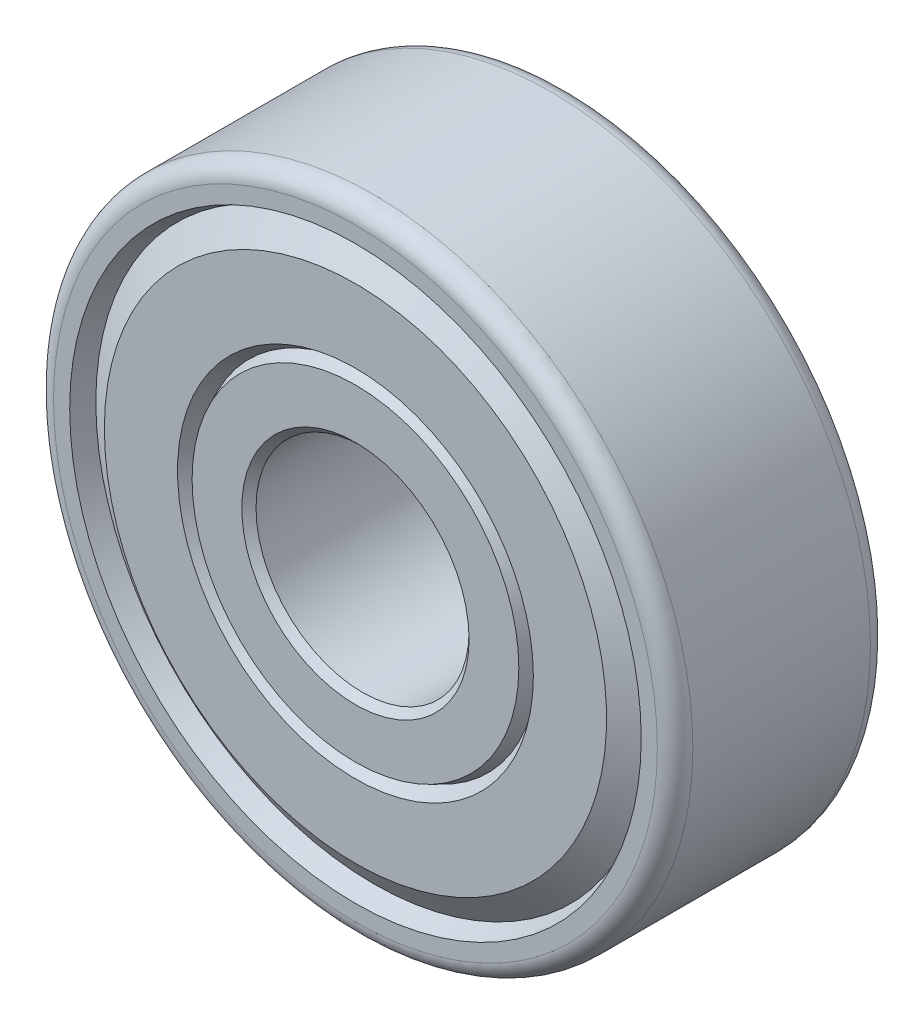
ISO-10303-21;
HEADER;
FILE_DESCRIPTION(('STEP AP214'),'2;1');
FILE_NAME('part.step','',(''),(''),'','','');
FILE_SCHEMA(('AUTOMOTIVE_DESIGN { 1 0 10303 214 1 1 1 1 }'));
ENDSEC;
DATA;
#1=APPLICATION_CONTEXT('core data for automotive mechanical design processes');
#2=APPLICATION_PROTOCOL_DEFINITION('international standard','automotive_design',2000,#1);
#3=PRODUCT_CONTEXT('',#1,'mechanical');
#4=PRODUCT('Part','Part','',(#3));
#5=PRODUCT_RELATED_PRODUCT_CATEGORY('part','',(#4));
#6=PRODUCT_DEFINITION_FORMATION('','',#4);
#7=PRODUCT_DEFINITION_CONTEXT('part definition',#1,'design');
#8=PRODUCT_DEFINITION('design','',#6,#7);
#9=PRODUCT_DEFINITION_SHAPE('','',#8);
#10=(LENGTH_UNIT() NAMED_UNIT(*) SI_UNIT(.MILLI.,.METRE.));
#11=(NAMED_UNIT(*) PLANE_ANGLE_UNIT() SI_UNIT($,.RADIAN.));
#12=(NAMED_UNIT(*) SI_UNIT($,.STERADIAN.) SOLID_ANGLE_UNIT());
#13=UNCERTAINTY_MEASURE_WITH_UNIT(LENGTH_MEASURE(1.E-05),#10,'distance_accuracy_value','');
#14=(GEOMETRIC_REPRESENTATION_CONTEXT(3) GLOBAL_UNCERTAINTY_ASSIGNED_CONTEXT((#13)) GLOBAL_UNIT_ASSIGNED_CONTEXT((#10,
#11,#12)) REPRESENTATION_CONTEXT('',''));
#15=CARTESIAN_POINT('',(0.,0.,0.));
#16=DIRECTION('',(0.,0.,1.));
#17=DIRECTION('',(1.,0.,0.));
#18=AXIS2_PLACEMENT_3D('',#15,#16,#17);
#19=CARTESIAN_POINT('',(0.,0.,0.));
#20=DIRECTION('',(0.,0.,1.));
#21=DIRECTION('',(1.,0.,0.));
#22=AXIS2_PLACEMENT_3D('',#19,#20,#21);
#23=CYLINDRICAL_SURFACE('',#22,4.7625);
#24=CARTESIAN_POINT('',(0.,0.,-4.44499999986192));
#25=DIRECTION('',(0.,0.,-1.));
#26=DIRECTION('',(-1.,0.,0.));
#27=AXIS2_PLACEMENT_3D('',#24,#25,#26);
#28=CIRCLE('',#27,4.76250000008349);
#29=CARTESIAN_POINT('',(-4.76250000008349,0.,-4.44499999986192));
#30=VERTEX_POINT('',#29);
#31=EDGE_CURVE('E331',#30,#30,#28,.T.);
#32=ORIENTED_EDGE('',*,*,#31,.T.);
#33=EDGE_LOOP('',(#32));
#34=FACE_BOUND('',#33,.T.);
#35=CARTESIAN_POINT('',(0.,0.,4.44499999986192));
#36=DIRECTION('',(0.,0.,1.));
#37=DIRECTION('',(-1.,0.,0.));
#38=AXIS2_PLACEMENT_3D('',#35,#36,#37);
#39=CIRCLE('',#38,4.76250000008349);
#40=CARTESIAN_POINT('',(-4.76250000008349,0.,4.44499999986192));
#41=VERTEX_POINT('',#40);
#42=EDGE_CURVE('E334',#41,#41,#39,.T.);
#43=ORIENTED_EDGE('',*,*,#42,.T.);
#44=EDGE_LOOP('',(#43));
#45=FACE_BOUND('',#44,.T.);
#46=ADVANCED_FACE('F16',(#34,#45),#23,.F.);
#47=CARTESIAN_POINT('',(0.,0.,-4.7624999999698));
#48=DIRECTION('',(0.,0.,-1.));
#49=DIRECTION('',(-1.,0.,0.));
#50=AXIS2_PLACEMENT_3D('',#47,#48,#49);
#51=CONICAL_SURFACE('',#50,5.07999999962294,0.785398162502276);
#52=CARTESIAN_POINT('',(0.,0.,-4.76250000008349));
#53=DIRECTION('',(0.,0.,-1.));
#54=DIRECTION('',(-1.,0.,0.));
#55=AXIS2_PLACEMENT_3D('',#52,#53,#54);
#56=CIRCLE('',#55,5.07999999973663);
#57=CARTESIAN_POINT('',(-5.07999999973663,0.,-4.76250000008349));
#58=VERTEX_POINT('',#57);
#59=EDGE_CURVE('E336',#58,#58,#56,.F.);
#60=ORIENTED_EDGE('',*,*,#59,.F.);
#61=EDGE_LOOP('',(#60));
#62=FACE_BOUND('',#61,.T.);
#63=ORIENTED_EDGE('',*,*,#31,.F.);
#64=EDGE_LOOP('',(#63));
#65=FACE_BOUND('',#64,.T.);
#66=ADVANCED_FACE('F260',(#62,#65),#51,.F.);
#67=CARTESIAN_POINT('',(0.,0.,4.7624999999698));
#68=DIRECTION('',(0.,0.,1.));
#69=DIRECTION('',(1.,0.,0.));
#70=AXIS2_PLACEMENT_3D('',#67,#68,#69);
#71=CONICAL_SURFACE('',#70,5.07999999962294,0.785398162502276);
#72=ORIENTED_EDGE('',*,*,#42,.F.);
#73=EDGE_LOOP('',(#72));
#74=FACE_BOUND('',#73,.T.);
#75=CARTESIAN_POINT('',(0.,0.,4.76250000008349));
#76=DIRECTION('',(0.,0.,1.));
#77=DIRECTION('',(1.,0.,0.));
#78=AXIS2_PLACEMENT_3D('',#75,#76,#77);
#79=CIRCLE('',#78,5.07999999973663);
#80=CARTESIAN_POINT('',(5.07999999973663,0.,4.76250000008349));
#81=VERTEX_POINT('',#80);
#82=EDGE_CURVE('E341',#81,#81,#79,.T.);
#83=ORIENTED_EDGE('',*,*,#82,.T.);
#84=EDGE_LOOP('',(#83));
#85=FACE_BOUND('',#84,.T.);
#86=ADVANCED_FACE('F252',(#74,#85),#71,.F.);
#87=CARTESIAN_POINT('',(0.,0.,-4.7625));
#88=DIRECTION('',(0.,0.,-1.));
#89=DIRECTION('',(-1.,0.,0.));
#90=AXIS2_PLACEMENT_3D('',#87,#88,#89);
#91=PLANE('',#90);
#92=ORIENTED_EDGE('',*,*,#59,.T.);
#93=EDGE_LOOP('',(#92));
#94=FACE_BOUND('',#93,.T.);
#95=CARTESIAN_POINT('',(0.,0.,-4.7625));
#96=DIRECTION('',(0.,0.,1.));
#97=DIRECTION('',(1.,0.,0.));
#98=AXIS2_PLACEMENT_3D('',#95,#96,#97);
#99=CIRCLE('',#98,7.3025);
#100=CARTESIAN_POINT('',(7.3025,0.,-4.7625));
#101=VERTEX_POINT('',#100);
#102=EDGE_CURVE('E378',#101,#101,#99,.T.);
#103=ORIENTED_EDGE('',*,*,#102,.F.);
#104=EDGE_LOOP('',(#103));
#105=FACE_BOUND('',#104,.T.);
#106=ADVANCED_FACE('F244',(#94,#105),#91,.T.);
#107=CARTESIAN_POINT('',(0.,0.,4.7625));
#108=DIRECTION('',(0.,0.,-1.));
#109=DIRECTION('',(-1.,0.,0.));
#110=AXIS2_PLACEMENT_3D('',#107,#108,#109);
#111=PLANE('',#110);
#112=ORIENTED_EDGE('',*,*,#82,.F.);
#113=EDGE_LOOP('',(#112));
#114=FACE_BOUND('',#113,.T.);
#115=CARTESIAN_POINT('',(0.,0.,4.76250000005854));
#116=DIRECTION('',(0.,0.,-1.));
#117=DIRECTION('',(-1.,0.,0.));
#118=AXIS2_PLACEMENT_3D('',#115,#116,#117);
#119=CIRCLE('',#118,7.30250000013546);
#120=CARTESIAN_POINT('',(-7.30250000013546,0.,4.76250000005854));
#121=VERTEX_POINT('',#120);
#122=EDGE_CURVE('E375',#121,#121,#119,.T.);
#123=ORIENTED_EDGE('',*,*,#122,.F.);
#124=EDGE_LOOP('',(#123));
#125=FACE_BOUND('',#124,.T.);
#126=ADVANCED_FACE('F236',(#114,#125),#111,.F.);
#127=CARTESIAN_POINT('',(0.,0.,-4.18132890087755));
#128=DIRECTION('',(0.,0.,1.));
#129=DIRECTION('',(1.,0.,0.));
#130=AXIS2_PLACEMENT_3D('',#127,#128,#129);
#131=CONICAL_SURFACE('',#130,7.55365742462336,0.407917424824535);
#132=CARTESIAN_POINT('',(0.,0.,-4.18132890087755));
#133=DIRECTION('',(0.,0.,-1.));
#134=DIRECTION('',(-1.,0.,0.));
#135=AXIS2_PLACEMENT_3D('',#132,#133,#134);
#136=CIRCLE('',#135,7.55365742462337);
#137=CARTESIAN_POINT('',(-7.55365742462337,0.,-4.18132890087755));
#138=VERTEX_POINT('',#137);
#139=EDGE_CURVE('E346',#138,#138,#136,.T.);
#140=ORIENTED_EDGE('',*,*,#139,.T.);
#141=EDGE_LOOP('',(#140));
#142=FACE_BOUND('',#141,.T.);
#143=ORIENTED_EDGE('',*,*,#102,.T.);
#144=EDGE_LOOP('',(#143));
#145=FACE_BOUND('',#144,.T.);
#146=ADVANCED_FACE('F228',(#142,#145),#131,.T.);
#147=CARTESIAN_POINT('',(0.,0.,4.18132890087755));
#148=DIRECTION('',(0.,0.,-1.));
#149=DIRECTION('',(-1.,0.,0.));
#150=AXIS2_PLACEMENT_3D('',#147,#148,#149);
#151=CONICAL_SURFACE('',#150,7.55365742446263,0.407917424358415);
#152=CARTESIAN_POINT('',(0.,0.,4.18132890066575));
#153=DIRECTION('',(0.,0.,1.));
#154=DIRECTION('',(-1.,0.,0.));
#155=AXIS2_PLACEMENT_3D('',#152,#153,#154);
#156=CIRCLE('',#155,7.55365742477154);
#157=CARTESIAN_POINT('',(-7.55365742477154,0.,4.18132890066575));
#158=VERTEX_POINT('',#157);
#159=EDGE_CURVE('E374',#158,#158,#156,.T.);
#160=ORIENTED_EDGE('',*,*,#159,.T.);
#161=EDGE_LOOP('',(#160));
#162=FACE_BOUND('',#161,.T.);
#163=ORIENTED_EDGE('',*,*,#122,.T.);
#164=EDGE_LOOP('',(#163));
#165=FACE_BOUND('',#164,.T.);
#166=ADVANCED_FACE('F220',(#162,#165),#151,.T.);
#167=CARTESIAN_POINT('',(0.,0.,-4.7625));
#168=DIRECTION('',(0.,0.,-1.));
#169=DIRECTION('',(-1.,0.,0.));
#170=AXIS2_PLACEMENT_3D('',#167,#168,#169);
#171=CONICAL_SURFACE('',#170,7.952136972928,0.601029540804804);
#172=ORIENTED_EDGE('',*,*,#139,.F.);
#173=EDGE_LOOP('',(#172));
#174=FACE_BOUND('',#173,.T.);
#175=CARTESIAN_POINT('',(0.,0.,-4.7625));
#176=DIRECTION('',(0.,0.,-1.));
#177=DIRECTION('',(-1.,0.,0.));
#178=AXIS2_PLACEMENT_3D('',#175,#176,#177);
#179=CIRCLE('',#178,7.952136972928);
#180=CARTESIAN_POINT('',(-7.952136972928,0.,-4.7625));
#181=VERTEX_POINT('',#180);
#182=EDGE_CURVE('E370',#181,#181,#179,.F.);
#183=ORIENTED_EDGE('',*,*,#182,.F.);
#184=EDGE_LOOP('',(#183));
#185=FACE_BOUND('',#184,.T.);
#186=ADVANCED_FACE('F212',(#174,#185),#171,.F.);
#187=CARTESIAN_POINT('',(0.,0.,4.7625));
#188=DIRECTION('',(0.,0.,1.));
#189=DIRECTION('',(1.,0.,0.));
#190=AXIS2_PLACEMENT_3D('',#187,#188,#189);
#191=CONICAL_SURFACE('',#190,7.95213697263462,0.601029540118035);
#192=CARTESIAN_POINT('',(0.,0.,4.7625));
#193=DIRECTION('',(0.,0.,1.));
#194=DIRECTION('',(1.,0.,0.));
#195=AXIS2_PLACEMENT_3D('',#192,#193,#194);
#196=CIRCLE('',#195,7.95213697263462);
#197=CARTESIAN_POINT('',(7.95213697263462,0.,4.7625));
#198=VERTEX_POINT('',#197);
#199=EDGE_CURVE('E366',#198,#198,#196,.T.);
#200=ORIENTED_EDGE('',*,*,#199,.T.);
#201=EDGE_LOOP('',(#200));
#202=FACE_BOUND('',#201,.T.);
#203=ORIENTED_EDGE('',*,*,#159,.F.);
#204=EDGE_LOOP('',(#203));
#205=FACE_BOUND('',#204,.T.);
#206=ADVANCED_FACE('F204',(#202,#205),#191,.F.);
#207=CARTESIAN_POINT('',(0.,0.,-4.7625));
#208=DIRECTION('',(0.,0.,-1.));
#209=DIRECTION('',(-1.,0.,0.));
#210=AXIS2_PLACEMENT_3D('',#207,#208,#209);
#211=PLANE('',#210);
#212=ORIENTED_EDGE('',*,*,#182,.T.);
#213=EDGE_LOOP('',(#212));
#214=FACE_BOUND('',#213,.T.);
#215=CARTESIAN_POINT('',(0.,0.,-4.7625));
#216=DIRECTION('',(0.,0.,1.));
#217=DIRECTION('',(1.,0.,0.));
#218=AXIS2_PLACEMENT_3D('',#215,#216,#217);
#219=CIRCLE('',#218,11.2241326943492);
#220=CARTESIAN_POINT('',(11.2241326943492,0.,-4.7625));
#221=VERTEX_POINT('',#220);
#222=EDGE_CURVE('E362',#221,#221,#219,.T.);
#223=ORIENTED_EDGE('',*,*,#222,.F.);
#224=EDGE_LOOP('',(#223));
#225=FACE_BOUND('',#224,.T.);
#226=ADVANCED_FACE('F196',(#214,#225),#211,.T.);
#227=CARTESIAN_POINT('',(0.,0.,4.7625));
#228=DIRECTION('',(0.,0.,-1.));
#229=DIRECTION('',(-1.,0.,0.));
#230=AXIS2_PLACEMENT_3D('',#227,#228,#229);
#231=PLANE('',#230);
#232=ORIENTED_EDGE('',*,*,#199,.F.);
#233=EDGE_LOOP('',(#232));
#234=FACE_BOUND('',#233,.T.);
#235=CARTESIAN_POINT('',(0.,0.,4.76250000067259));
#236=DIRECTION('',(0.,0.,-1.));
#237=DIRECTION('',(-1.,0.,0.));
#238=AXIS2_PLACEMENT_3D('',#235,#236,#237);
#239=CIRCLE('',#238,11.2241326948103);
#240=CARTESIAN_POINT('',(-11.2241326948103,0.,4.76250000067259));
#241=VERTEX_POINT('',#240);
#242=EDGE_CURVE('E357',#241,#241,#239,.T.);
#243=ORIENTED_EDGE('',*,*,#242,.F.);
#244=EDGE_LOOP('',(#243));
#245=FACE_BOUND('',#244,.T.);
#246=ADVANCED_FACE('F188',(#234,#245),#231,.F.);
#247=CARTESIAN_POINT('',(0.,0.,-3.93017144225871));
#248=DIRECTION('',(0.,0.,1.));
#249=DIRECTION('',(1.,0.,0.));
#250=AXIS2_PLACEMENT_3D('',#247,#248,#249);
#251=CONICAL_SURFACE('',#250,12.4380602466955,0.969766785990084);
#252=CARTESIAN_POINT('',(0.,0.,-3.93017144225872));
#253=DIRECTION('',(0.,0.,-1.));
#254=DIRECTION('',(-1.,0.,0.));
#255=AXIS2_PLACEMENT_3D('',#252,#253,#254);
#256=CIRCLE('',#255,12.4380602466955);
#257=CARTESIAN_POINT('',(-12.4380602466955,0.,-3.93017144225872));
#258=VERTEX_POINT('',#257);
#259=EDGE_CURVE('E361',#258,#258,#256,.T.);
#260=ORIENTED_EDGE('',*,*,#259,.T.);
#261=EDGE_LOOP('',(#260));
#262=FACE_BOUND('',#261,.T.);
#263=ORIENTED_EDGE('',*,*,#222,.T.);
#264=EDGE_LOOP('',(#263));
#265=FACE_BOUND('',#264,.T.);
#266=ADVANCED_FACE('F180',(#262,#265),#251,.T.);
#267=CARTESIAN_POINT('',(0.,0.,3.93017144225871));
#268=DIRECTION('',(0.,0.,-1.));
#269=DIRECTION('',(-1.,0.,0.));
#270=AXIS2_PLACEMENT_3D('',#267,#268,#269);
#271=CONICAL_SURFACE('',#270,12.4380602452534,0.969766784881962);
#272=CARTESIAN_POINT('',(0.,0.,3.93017144168615));
#273=DIRECTION('',(0.,0.,1.));
#274=DIRECTION('',(-1.,0.,0.));
#275=AXIS2_PLACEMENT_3D('',#272,#273,#274);
#276=CIRCLE('',#275,12.4380602466765);
#277=CARTESIAN_POINT('',(-12.4380602466765,0.,3.93017144168615));
#278=VERTEX_POINT('',#277);
#279=EDGE_CURVE('E356',#278,#278,#276,.T.);
#280=ORIENTED_EDGE('',*,*,#279,.T.);
#281=EDGE_LOOP('',(#280));
#282=FACE_BOUND('',#281,.T.);
#283=ORIENTED_EDGE('',*,*,#242,.T.);
#284=EDGE_LOOP('',(#283));
#285=FACE_BOUND('',#284,.T.);
#286=ADVANCED_FACE('F172',(#282,#285),#271,.T.);
#287=CARTESIAN_POINT('',(0.,0.,-4.7625));
#288=DIRECTION('',(0.,0.,-1.));
#289=DIRECTION('',(-1.,0.,0.));
#290=AXIS2_PLACEMENT_3D('',#287,#288,#289);
#291=CONICAL_SURFACE('',#290,12.7729368128599,0.382519398268516);
#292=ORIENTED_EDGE('',*,*,#259,.F.);
#293=EDGE_LOOP('',(#292));
#294=FACE_BOUND('',#293,.T.);
#295=CARTESIAN_POINT('',(0.,0.,-4.7625));
#296=DIRECTION('',(0.,0.,-1.));
#297=DIRECTION('',(-1.,0.,0.));
#298=AXIS2_PLACEMENT_3D('',#295,#296,#297);
#299=CIRCLE('',#298,12.7729368128599);
#300=CARTESIAN_POINT('',(-12.7729368128599,0.,-4.7625));
#301=VERTEX_POINT('',#300);
#302=EDGE_CURVE('E352',#301,#301,#299,.F.);
#303=ORIENTED_EDGE('',*,*,#302,.F.);
#304=EDGE_LOOP('',(#303));
#305=FACE_BOUND('',#304,.T.);
#306=ADVANCED_FACE('F164',(#294,#305),#291,.F.);
#307=CARTESIAN_POINT('',(0.,0.,4.7625));
#308=DIRECTION('',(0.,0.,1.));
#309=DIRECTION('',(1.,0.,0.));
#310=AXIS2_PLACEMENT_3D('',#307,#308,#309);
#311=CONICAL_SURFACE('',#310,12.7729368126486,0.382519397831445);
#312=CARTESIAN_POINT('',(0.,0.,4.7625));
#313=DIRECTION('',(0.,0.,1.));
#314=DIRECTION('',(1.,0.,0.));
#315=AXIS2_PLACEMENT_3D('',#312,#313,#314);
#316=CIRCLE('',#315,12.7729368126486);
#317=CARTESIAN_POINT('',(12.7729368126486,0.,4.7625));
#318=VERTEX_POINT('',#317);
#319=EDGE_CURVE('E56',#318,#318,#316,.T.);
#320=ORIENTED_EDGE('',*,*,#319,.T.);
#321=EDGE_LOOP('',(#320));
#322=FACE_BOUND('',#321,.T.);
#323=ORIENTED_EDGE('',*,*,#279,.F.);
#324=EDGE_LOOP('',(#323));
#325=FACE_BOUND('',#324,.T.);
#326=ADVANCED_FACE('F157',(#322,#325),#311,.F.);
#327=CARTESIAN_POINT('',(0.,0.,-4.7625));
#328=DIRECTION('',(0.,0.,-1.));
#329=DIRECTION('',(-1.,0.,0.));
#330=AXIS2_PLACEMENT_3D('',#327,#328,#329);
#331=PLANE('',#330);
#332=ORIENTED_EDGE('',*,*,#302,.T.);
#333=EDGE_LOOP('',(#332));
#334=FACE_BOUND('',#333,.T.);
#335=CARTESIAN_POINT('',(0.,0.,-4.76249999999999));
#336=DIRECTION('',(0.,0.,1.));
#337=DIRECTION('',(1.,0.,0.));
#338=AXIS2_PLACEMENT_3D('',#335,#336,#337);
#339=CIRCLE('',#338,13.49375);
#340=CARTESIAN_POINT('',(13.49375,0.,-4.7625));
#341=VERTEX_POINT('',#340);
#342=CARTESIAN_POINT('',(-13.49375,0.,-4.7625));
#343=VERTEX_POINT('',#342);
#344=EDGE_CURVE('E46',#341,#343,#339,.T.);
#345=ORIENTED_EDGE('',*,*,#344,.F.);
#346=CARTESIAN_POINT('',(0.,0.,-4.76249999999999));
#347=DIRECTION('',(0.,0.,1.));
#348=DIRECTION('',(-1.,0.,0.));
#349=AXIS2_PLACEMENT_3D('',#346,#347,#348);
#350=CIRCLE('',#349,13.49375);
#351=EDGE_CURVE('E53',#343,#341,#350,.T.);
#352=ORIENTED_EDGE('',*,*,#351,.F.);
#353=EDGE_LOOP('',(#345,#352));
#354=FACE_BOUND('',#353,.T.);
#355=ADVANCED_FACE('F52',(#334,#354),#331,.T.);
#356=CARTESIAN_POINT('',(0.,0.,4.7625));
#357=DIRECTION('',(0.,0.,-1.));
#358=DIRECTION('',(-1.,0.,0.));
#359=AXIS2_PLACEMENT_3D('',#356,#357,#358);
#360=PLANE('',#359);
#361=ORIENTED_EDGE('',*,*,#319,.F.);
#362=EDGE_LOOP('',(#361));
#363=FACE_BOUND('',#362,.T.);
#364=CARTESIAN_POINT('',(0.,0.,4.76250000000002));
#365=DIRECTION('',(0.,0.,-1.));
#366=DIRECTION('',(1.,0.,0.));
#367=AXIS2_PLACEMENT_3D('',#364,#365,#366);
#368=CIRCLE('',#367,13.49375);
#369=CARTESIAN_POINT('',(13.49375,0.,4.76250000000001));
#370=VERTEX_POINT('',#369);
#371=CARTESIAN_POINT('',(-13.49375,0.,4.76250000000001));
#372=VERTEX_POINT('',#371);
#373=EDGE_CURVE('E62',#370,#372,#368,.T.);
#374=ORIENTED_EDGE('',*,*,#373,.F.);
#375=CARTESIAN_POINT('',(0.,0.,4.76250000000002));
#376=DIRECTION('',(0.,0.,-1.));
#377=DIRECTION('',(-1.,0.,0.));
#378=AXIS2_PLACEMENT_3D('',#375,#376,#377);
#379=CIRCLE('',#378,13.49375);
#380=EDGE_CURVE('E36',#372,#370,#379,.T.);
#381=ORIENTED_EDGE('',*,*,#380,.F.);
#382=EDGE_LOOP('',(#374,#381));
#383=FACE_BOUND('',#382,.T.);
#384=ADVANCED_FACE('F83',(#363,#383),#360,.F.);
#385=CARTESIAN_POINT('',(0.,0.,-3.96874999999999));
#386=DIRECTION('',(0.,0.,1.));
#387=DIRECTION('',(1.,0.,0.));
#388=AXIS2_PLACEMENT_3D('',#385,#386,#387);
#389=TOROIDAL_SURFACE('',#388,13.49375,0.79375);
#390=ORIENTED_EDGE('',*,*,#344,.T.);
#391=ORIENTED_EDGE('',*,*,#351,.T.);
#392=EDGE_LOOP('',(#390,#391));
#393=FACE_BOUND('',#392,.T.);
#394=CARTESIAN_POINT('',(0.,0.,-3.96874999999999));
#395=DIRECTION('',(0.,0.,1.));
#396=DIRECTION('',(1.,0.,0.));
#397=AXIS2_PLACEMENT_3D('',#394,#395,#396);
#398=CIRCLE('',#397,14.2875);
#399=CARTESIAN_POINT('',(14.2875,0.,-3.96874999999999));
#400=VERTEX_POINT('',#399);
#401=EDGE_CURVE('E28',#400,#400,#398,.T.);
#402=ORIENTED_EDGE('',*,*,#401,.F.);
#403=EDGE_LOOP('',(#402));
#404=FACE_BOUND('',#403,.T.);
#405=ADVANCED_FACE('F59',(#393,#404),#389,.T.);
#406=CARTESIAN_POINT('',(0.,0.,3.96875000000002));
#407=DIRECTION('',(0.,0.,-1.));
#408=DIRECTION('',(-1.,0.,0.));
#409=AXIS2_PLACEMENT_3D('',#406,#407,#408);
#410=TOROIDAL_SURFACE('',#409,13.49375,0.79375);
#411=ORIENTED_EDGE('',*,*,#380,.T.);
#412=ORIENTED_EDGE('',*,*,#373,.T.);
#413=EDGE_LOOP('',(#411,#412));
#414=FACE_BOUND('',#413,.T.);
#415=CARTESIAN_POINT('',(0.,0.,3.96875000000002));
#416=DIRECTION('',(0.,0.,1.));
#417=DIRECTION('',(1.,0.,0.));
#418=AXIS2_PLACEMENT_3D('',#415,#416,#417);
#419=CIRCLE('',#418,14.2875);
#420=CARTESIAN_POINT('',(14.2875,0.,3.96875000000002));
#421=VERTEX_POINT('',#420);
#422=EDGE_CURVE('E11',#421,#421,#419,.F.);
#423=ORIENTED_EDGE('',*,*,#422,.F.);
#424=EDGE_LOOP('',(#423));
#425=FACE_BOUND('',#424,.T.);
#426=ADVANCED_FACE('F82',(#414,#425),#410,.T.);
#427=CARTESIAN_POINT('',(0.,0.,0.));
#428=DIRECTION('',(0.,0.,1.));
#429=DIRECTION('',(1.,0.,0.));
#430=AXIS2_PLACEMENT_3D('',#427,#428,#429);
#431=CYLINDRICAL_SURFACE('',#430,14.2875);
#432=ORIENTED_EDGE('',*,*,#422,.T.);
#433=EDGE_LOOP('',(#432));
#434=FACE_BOUND('',#433,.T.);
#435=ORIENTED_EDGE('',*,*,#401,.T.);
#436=EDGE_LOOP('',(#435));
#437=FACE_BOUND('',#436,.T.);
#438=ADVANCED_FACE('F129',(#434,#437),#431,.T.);
#439=CLOSED_SHELL('',(#46,#66,#86,#106,#126,#146,#166,#186,#206,#226,#246,#266,#286,#306,#326,
#355,#384,#405,#426,#438));
#440=MANIFOLD_SOLID_BREP('B1',#439);
#441=ADVANCED_BREP_SHAPE_REPRESENTATION('',(#18,#440),#14);
#442=SHAPE_DEFINITION_REPRESENTATION(#9,#441);
ENDSEC;
END-ISO-10303-21;
